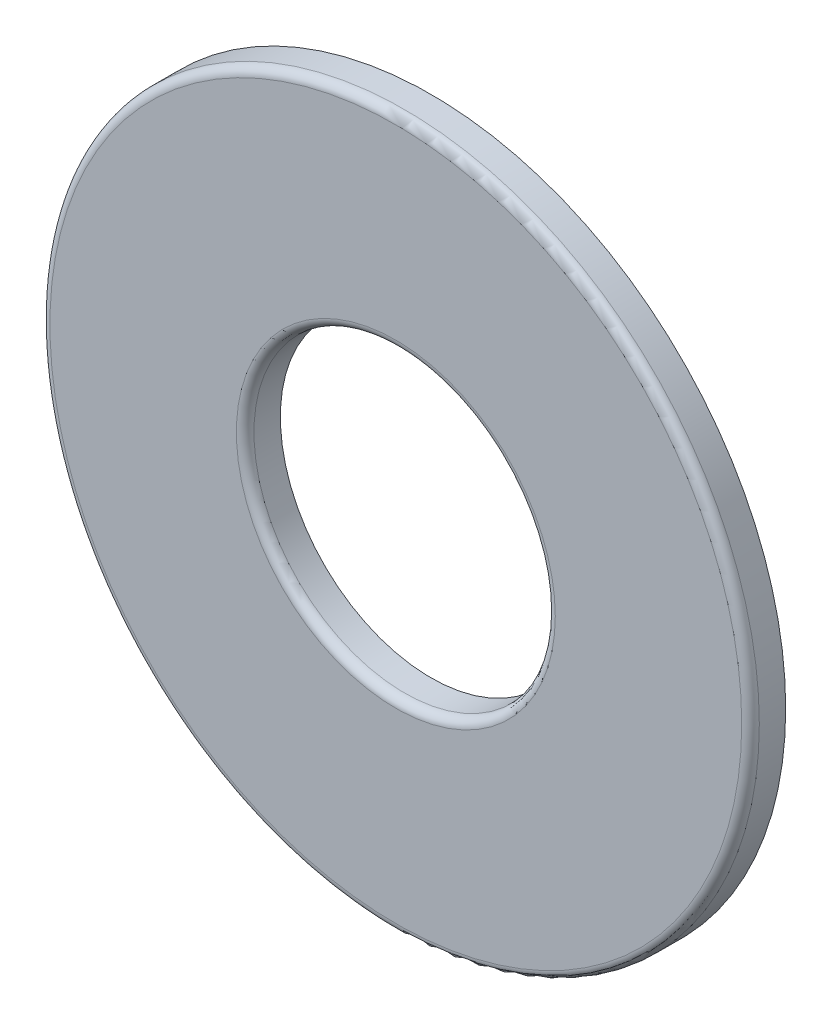
ISO-10303-21;
HEADER;
FILE_DESCRIPTION(('STEP AP214'),'2;1');
FILE_NAME('part.step','',(''),(''),'','','');
FILE_SCHEMA(('AUTOMOTIVE_DESIGN { 1 0 10303 214 1 1 1 1 }'));
ENDSEC;
DATA;
#1=APPLICATION_CONTEXT('core data for automotive mechanical design processes');
#2=APPLICATION_PROTOCOL_DEFINITION('international standard','automotive_design',2000,#1);
#3=PRODUCT_CONTEXT('',#1,'mechanical');
#4=PRODUCT('Part','Part','',(#3));
#5=PRODUCT_RELATED_PRODUCT_CATEGORY('part','',(#4));
#6=PRODUCT_DEFINITION_FORMATION('','',#4);
#7=PRODUCT_DEFINITION_CONTEXT('part definition',#1,'design');
#8=PRODUCT_DEFINITION('design','',#6,#7);
#9=PRODUCT_DEFINITION_SHAPE('','',#8);
#10=(LENGTH_UNIT() NAMED_UNIT(*) SI_UNIT(.MILLI.,.METRE.));
#11=(NAMED_UNIT(*) PLANE_ANGLE_UNIT() SI_UNIT($,.RADIAN.));
#12=(NAMED_UNIT(*) SI_UNIT($,.STERADIAN.) SOLID_ANGLE_UNIT());
#13=UNCERTAINTY_MEASURE_WITH_UNIT(LENGTH_MEASURE(1.E-05),#10,'distance_accuracy_value','');
#14=(GEOMETRIC_REPRESENTATION_CONTEXT(3) GLOBAL_UNCERTAINTY_ASSIGNED_CONTEXT((#13)) GLOBAL_UNIT_ASSIGNED_CONTEXT((#10,
#11,#12)) REPRESENTATION_CONTEXT('',''));
#15=CARTESIAN_POINT('',(0.,0.,0.));
#16=DIRECTION('',(0.,0.,1.));
#17=DIRECTION('',(1.,0.,0.));
#18=AXIS2_PLACEMENT_3D('',#15,#16,#17);
#19=CARTESIAN_POINT('',(0.,0.,0.787399999999999));
#20=DIRECTION('',(0.,0.,1.));
#21=DIRECTION('',(1.,0.,0.));
#22=AXIS2_PLACEMENT_3D('',#19,#20,#21);
#23=PLANE('',#22);
#24=CARTESIAN_POINT('',(0.,0.,0.787399999999999));
#25=DIRECTION('',(0.,0.,1.));
#26=DIRECTION('',(1.,0.,0.));
#27=AXIS2_PLACEMENT_3D('',#24,#25,#26);
#28=CIRCLE('',#27,15.4813);
#29=CARTESIAN_POINT('',(15.4813,0.,0.787399999999999));
#30=VERTEX_POINT('',#29);
#31=EDGE_CURVE('E50',#30,#30,#28,.T.);
#32=ORIENTED_EDGE('',*,*,#31,.T.);
#33=EDGE_LOOP('',(#32));
#34=FACE_BOUND('',#33,.T.);
#35=CARTESIAN_POINT('',(0.,0.,0.787399999999999));
#36=DIRECTION('',(0.,0.,1.));
#37=DIRECTION('',(1.,0.,0.));
#38=AXIS2_PLACEMENT_3D('',#35,#36,#37);
#39=CIRCLE('',#38,7.1374);
#40=CARTESIAN_POINT('',(7.1374,0.,0.787399999999999));
#41=VERTEX_POINT('',#40);
#42=EDGE_CURVE('E54',#41,#41,#39,.F.);
#43=ORIENTED_EDGE('',*,*,#42,.T.);
#44=EDGE_LOOP('',(#43));
#45=FACE_BOUND('',#44,.T.);
#46=ADVANCED_FACE('F39',(#34,#45),#23,.T.);
#47=CARTESIAN_POINT('',(0.,0.,0.787399999999999));
#48=DIRECTION('',(0.,0.,-1.));
#49=DIRECTION('',(-1.,0.,0.));
#50=AXIS2_PLACEMENT_3D('',#47,#48,#49);
#51=CYLINDRICAL_SURFACE('',#50,15.875);
#52=CARTESIAN_POINT('',(0.,0.,0.393699999999999));
#53=DIRECTION('',(0.,0.,1.));
#54=DIRECTION('',(1.,0.,0.));
#55=AXIS2_PLACEMENT_3D('',#52,#53,#54);
#56=CIRCLE('',#55,15.875);
#57=CARTESIAN_POINT('',(15.875,0.,0.393699999999999));
#58=VERTEX_POINT('',#57);
#59=EDGE_CURVE('E46',#58,#58,#56,.F.);
#60=ORIENTED_EDGE('',*,*,#59,.T.);
#61=EDGE_LOOP('',(#60));
#62=FACE_BOUND('',#61,.T.);
#63=CARTESIAN_POINT('',(0.,0.,-0.787400000000001));
#64=DIRECTION('',(0.,0.,1.));
#65=DIRECTION('',(1.,0.,0.));
#66=AXIS2_PLACEMENT_3D('',#63,#64,#65);
#67=CIRCLE('',#66,15.875);
#68=CARTESIAN_POINT('',(15.875,0.,-0.787400000000001));
#69=VERTEX_POINT('',#68);
#70=EDGE_CURVE('E59',#69,#69,#67,.T.);
#71=ORIENTED_EDGE('',*,*,#70,.T.);
#72=EDGE_LOOP('',(#71));
#73=FACE_BOUND('',#72,.T.);
#74=ADVANCED_FACE('F71',(#62,#73),#51,.T.);
#75=CARTESIAN_POINT('',(0.,0.,0.787399999999999));
#76=DIRECTION('',(0.,0.,-1.));
#77=DIRECTION('',(-1.,0.,0.));
#78=AXIS2_PLACEMENT_3D('',#75,#76,#77);
#79=CYLINDRICAL_SURFACE('',#78,6.7437);
#80=CARTESIAN_POINT('',(0.,0.,0.393699999999999));
#81=DIRECTION('',(0.,0.,1.));
#82=DIRECTION('',(1.,0.,0.));
#83=AXIS2_PLACEMENT_3D('',#80,#81,#82);
#84=CIRCLE('',#83,6.7437);
#85=CARTESIAN_POINT('',(6.7437,0.,0.393699999999999));
#86=VERTEX_POINT('',#85);
#87=EDGE_CURVE('E10',#86,#86,#84,.T.);
#88=ORIENTED_EDGE('',*,*,#87,.T.);
#89=EDGE_LOOP('',(#88));
#90=FACE_BOUND('',#89,.T.);
#91=CARTESIAN_POINT('',(0.,0.,-0.787400000000001));
#92=DIRECTION('',(0.,0.,1.));
#93=DIRECTION('',(1.,0.,0.));
#94=AXIS2_PLACEMENT_3D('',#91,#92,#93);
#95=CIRCLE('',#94,6.7437);
#96=CARTESIAN_POINT('',(6.7437,0.,-0.787400000000001));
#97=VERTEX_POINT('',#96);
#98=EDGE_CURVE('E62',#97,#97,#95,.T.);
#99=ORIENTED_EDGE('',*,*,#98,.F.);
#100=EDGE_LOOP('',(#99));
#101=FACE_BOUND('',#100,.T.);
#102=ADVANCED_FACE('F69',(#90,#101),#79,.F.);
#103=CARTESIAN_POINT('',(0.,0.,-0.787400000000001));
#104=DIRECTION('',(0.,0.,1.));
#105=DIRECTION('',(1.,0.,0.));
#106=AXIS2_PLACEMENT_3D('',#103,#104,#105);
#107=PLANE('',#106);
#108=ORIENTED_EDGE('',*,*,#98,.T.);
#109=EDGE_LOOP('',(#108));
#110=FACE_BOUND('',#109,.T.);
#111=ORIENTED_EDGE('',*,*,#70,.F.);
#112=EDGE_LOOP('',(#111));
#113=FACE_BOUND('',#112,.T.);
#114=ADVANCED_FACE('F66',(#110,#113),#107,.F.);
#115=CARTESIAN_POINT('',(0.,0.,0.393699999999999));
#116=DIRECTION('',(0.,0.,1.));
#117=DIRECTION('',(1.,0.,0.));
#118=AXIS2_PLACEMENT_3D('',#115,#116,#117);
#119=TOROIDAL_SURFACE('',#118,15.4813,0.3937);
#120=ORIENTED_EDGE('',*,*,#59,.F.);
#121=EDGE_LOOP('',(#120));
#122=FACE_BOUND('',#121,.T.);
#123=ORIENTED_EDGE('',*,*,#31,.F.);
#124=EDGE_LOOP('',(#123));
#125=FACE_BOUND('',#124,.T.);
#126=ADVANCED_FACE('F77',(#122,#125),#119,.T.);
#127=CARTESIAN_POINT('',(0.,0.,0.393699999999999));
#128=DIRECTION('',(0.,0.,1.));
#129=DIRECTION('',(1.,0.,0.));
#130=AXIS2_PLACEMENT_3D('',#127,#128,#129);
#131=TOROIDAL_SURFACE('',#130,7.1374,0.3937);
#132=ORIENTED_EDGE('',*,*,#42,.F.);
#133=EDGE_LOOP('',(#132));
#134=FACE_BOUND('',#133,.T.);
#135=ORIENTED_EDGE('',*,*,#87,.F.);
#136=EDGE_LOOP('',(#135));
#137=FACE_BOUND('',#136,.T.);
#138=ADVANCED_FACE('F41',(#134,#137),#131,.T.);
#139=CLOSED_SHELL('',(#46,#74,#102,#114,#126,#138));
#140=MANIFOLD_SOLID_BREP('B2',#139);
#141=ADVANCED_BREP_SHAPE_REPRESENTATION('',(#18,#140),#14);
#142=SHAPE_DEFINITION_REPRESENTATION(#9,#141);
ENDSEC;
END-ISO-10303-21;
